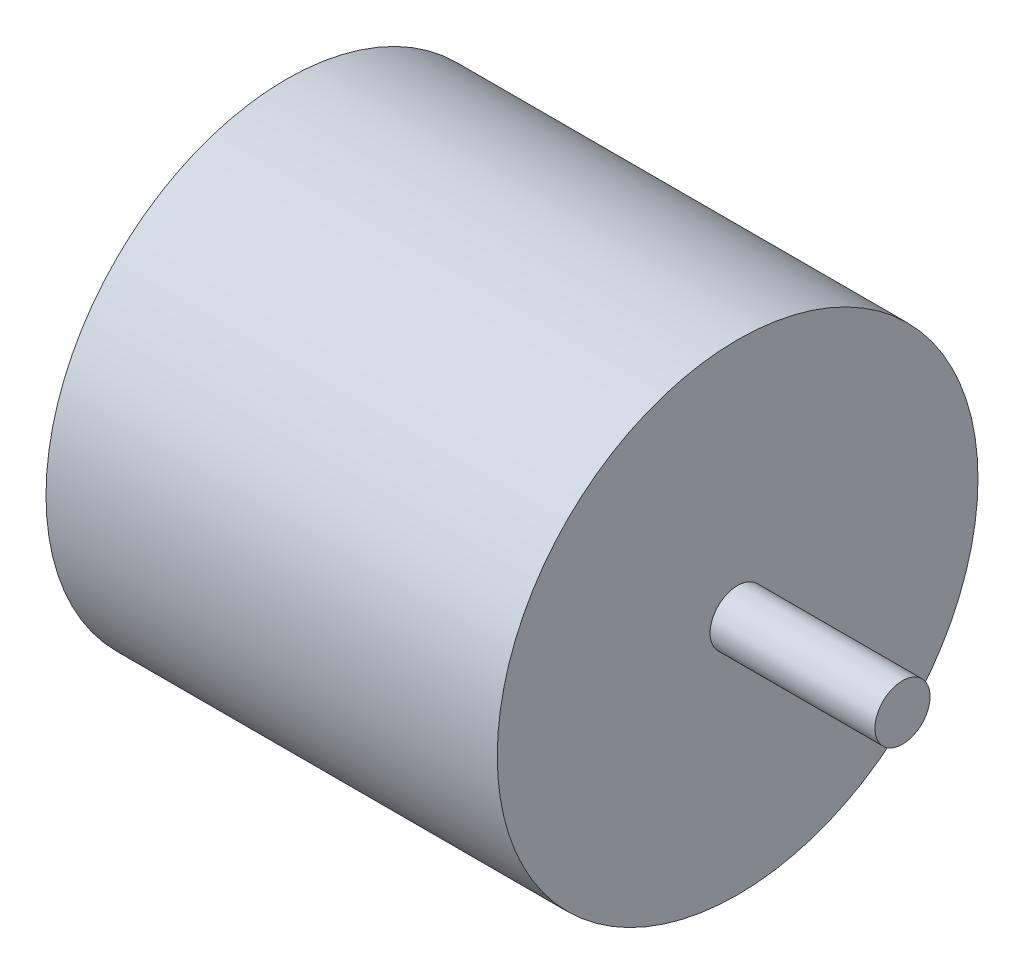
ISO-10303-21;
HEADER;
FILE_DESCRIPTION(('STEP AP214'),'2;1');
FILE_NAME('part.step','',(''),(''),'','','');
FILE_SCHEMA(('AUTOMOTIVE_DESIGN { 1 0 10303 214 1 1 1 1 }'));
ENDSEC;
DATA;
#1=APPLICATION_CONTEXT('core data for automotive mechanical design processes');
#2=APPLICATION_PROTOCOL_DEFINITION('international standard','automotive_design',2000,#1);
#3=PRODUCT_CONTEXT('',#1,'mechanical');
#4=PRODUCT('Part','Part','',(#3));
#5=PRODUCT_RELATED_PRODUCT_CATEGORY('part','',(#4));
#6=PRODUCT_DEFINITION_FORMATION('','',#4);
#7=PRODUCT_DEFINITION_CONTEXT('part definition',#1,'design');
#8=PRODUCT_DEFINITION('design','',#6,#7);
#9=PRODUCT_DEFINITION_SHAPE('','',#8);
#10=(LENGTH_UNIT() NAMED_UNIT(*) SI_UNIT(.MILLI.,.METRE.));
#11=(NAMED_UNIT(*) PLANE_ANGLE_UNIT() SI_UNIT($,.RADIAN.));
#12=(NAMED_UNIT(*) SI_UNIT($,.STERADIAN.) SOLID_ANGLE_UNIT());
#13=UNCERTAINTY_MEASURE_WITH_UNIT(LENGTH_MEASURE(1.E-05),#10,'distance_accuracy_value','');
#14=(GEOMETRIC_REPRESENTATION_CONTEXT(3) GLOBAL_UNCERTAINTY_ASSIGNED_CONTEXT((#13)) GLOBAL_UNIT_ASSIGNED_CONTEXT((#10,
#11,#12)) REPRESENTATION_CONTEXT('',''));
#15=CARTESIAN_POINT('',(0.,0.,0.));
#16=DIRECTION('',(0.,0.,1.));
#17=DIRECTION('',(1.,0.,0.));
#18=AXIS2_PLACEMENT_3D('',#15,#16,#17);
#19=CARTESIAN_POINT('',(-14.5,0.,0.));
#20=DIRECTION('',(1.,0.,0.));
#21=DIRECTION('',(0.,0.,-1.));
#22=AXIS2_PLACEMENT_3D('',#19,#20,#21);
#23=PLANE('',#22);
#24=CARTESIAN_POINT('',(-14.5,0.,0.));
#25=DIRECTION('',(-1.,0.,0.));
#26=DIRECTION('',(0.,0.,1.));
#27=AXIS2_PLACEMENT_3D('',#24,#25,#26);
#28=CIRCLE('',#27,1.5875);
#29=CARTESIAN_POINT('',(-14.5,0.,1.5875));
#30=VERTEX_POINT('',#29);
#31=EDGE_CURVE('E10',#30,#30,#28,.T.);
#32=ORIENTED_EDGE('',*,*,#31,.T.);
#33=EDGE_LOOP('',(#32));
#34=FACE_BOUND('',#33,.T.);
#35=ADVANCED_FACE('F35',(#34),#23,.F.);
#36=CARTESIAN_POINT('',(-313.759242265904,0.,0.));
#37=DIRECTION('',(-1.,0.,0.));
#38=DIRECTION('',(0.,0.,1.));
#39=AXIS2_PLACEMENT_3D('',#36,#37,#38);
#40=CYLINDRICAL_SURFACE('',#39,1.5875);
#41=ORIENTED_EDGE('',*,*,#31,.F.);
#42=EDGE_LOOP('',(#41));
#43=FACE_BOUND('',#42,.T.);
#44=CARTESIAN_POINT('',(-13.,0.,0.));
#45=DIRECTION('',(-1.,0.,0.));
#46=DIRECTION('',(0.,0.,1.));
#47=AXIS2_PLACEMENT_3D('',#44,#45,#46);
#48=CIRCLE('',#47,1.5875);
#49=CARTESIAN_POINT('',(-13.,0.,1.5875));
#50=VERTEX_POINT('',#49);
#51=EDGE_CURVE('E41',#50,#50,#48,.T.);
#52=ORIENTED_EDGE('',*,*,#51,.T.);
#53=EDGE_LOOP('',(#52));
#54=FACE_BOUND('',#53,.T.);
#55=ADVANCED_FACE('F73',(#43,#54),#40,.T.);
#56=CARTESIAN_POINT('',(-13.,1.5875,0.));
#57=DIRECTION('',(1.,0.,0.));
#58=DIRECTION('',(0.,0.,-1.));
#59=AXIS2_PLACEMENT_3D('',#56,#57,#58);
#60=PLANE('',#59);
#61=ORIENTED_EDGE('',*,*,#51,.F.);
#62=EDGE_LOOP('',(#61));
#63=FACE_BOUND('',#62,.T.);
#64=CARTESIAN_POINT('',(-13.,0.,0.));
#65=DIRECTION('',(-1.,0.,0.));
#66=DIRECTION('',(0.,0.,1.));
#67=AXIS2_PLACEMENT_3D('',#64,#65,#66);
#68=CIRCLE('',#67,13.85);
#69=CARTESIAN_POINT('',(-13.,0.,13.85));
#70=VERTEX_POINT('',#69);
#71=EDGE_CURVE('E45',#70,#70,#68,.T.);
#72=ORIENTED_EDGE('',*,*,#71,.T.);
#73=EDGE_LOOP('',(#72));
#74=FACE_BOUND('',#73,.T.);
#75=ADVANCED_FACE('F77',(#63,#74),#60,.F.);
#76=CARTESIAN_POINT('',(-313.759242265904,0.,0.));
#77=DIRECTION('',(-1.,0.,0.));
#78=DIRECTION('',(0.,0.,1.));
#79=AXIS2_PLACEMENT_3D('',#76,#77,#78);
#80=CYLINDRICAL_SURFACE('',#79,13.85);
#81=ORIENTED_EDGE('',*,*,#71,.F.);
#82=EDGE_LOOP('',(#81));
#83=FACE_BOUND('',#82,.T.);
#84=CARTESIAN_POINT('',(13.,0.,0.));
#85=DIRECTION('',(-1.,0.,0.));
#86=DIRECTION('',(0.,0.,1.));
#87=AXIS2_PLACEMENT_3D('',#84,#85,#86);
#88=CIRCLE('',#87,13.85);
#89=CARTESIAN_POINT('',(13.,0.,13.85));
#90=VERTEX_POINT('',#89);
#91=EDGE_CURVE('E49',#90,#90,#88,.T.);
#92=ORIENTED_EDGE('',*,*,#91,.T.);
#93=EDGE_LOOP('',(#92));
#94=FACE_BOUND('',#93,.T.);
#95=ADVANCED_FACE('F82',(#83,#94),#80,.T.);
#96=CARTESIAN_POINT('',(13.,13.85,0.));
#97=DIRECTION('',(-1.,0.,0.));
#98=DIRECTION('',(0.,0.,1.));
#99=AXIS2_PLACEMENT_3D('',#96,#97,#98);
#100=PLANE('',#99);
#101=ORIENTED_EDGE('',*,*,#91,.F.);
#102=EDGE_LOOP('',(#101));
#103=FACE_BOUND('',#102,.T.);
#104=CARTESIAN_POINT('',(13.,0.,0.));
#105=DIRECTION('',(-1.,0.,0.));
#106=DIRECTION('',(0.,0.,1.));
#107=AXIS2_PLACEMENT_3D('',#104,#105,#106);
#108=CIRCLE('',#107,1.5875);
#109=CARTESIAN_POINT('',(13.,0.,1.5875));
#110=VERTEX_POINT('',#109);
#111=EDGE_CURVE('E54',#110,#110,#108,.T.);
#112=ORIENTED_EDGE('',*,*,#111,.T.);
#113=EDGE_LOOP('',(#112));
#114=FACE_BOUND('',#113,.T.);
#115=ADVANCED_FACE('F69',(#103,#114),#100,.F.);
#116=CARTESIAN_POINT('',(-313.759242265904,0.,0.));
#117=DIRECTION('',(-1.,0.,0.));
#118=DIRECTION('',(0.,0.,1.));
#119=AXIS2_PLACEMENT_3D('',#116,#117,#118);
#120=CYLINDRICAL_SURFACE('',#119,1.5875);
#121=ORIENTED_EDGE('',*,*,#111,.F.);
#122=EDGE_LOOP('',(#121));
#123=FACE_BOUND('',#122,.T.);
#124=CARTESIAN_POINT('',(22.5,0.,0.));
#125=DIRECTION('',(-1.,0.,0.));
#126=DIRECTION('',(0.,0.,1.));
#127=AXIS2_PLACEMENT_3D('',#124,#125,#126);
#128=CIRCLE('',#127,1.5875);
#129=CARTESIAN_POINT('',(22.5,0.,1.5875));
#130=VERTEX_POINT('',#129);
#131=EDGE_CURVE('E57',#130,#130,#128,.T.);
#132=ORIENTED_EDGE('',*,*,#131,.T.);
#133=EDGE_LOOP('',(#132));
#134=FACE_BOUND('',#133,.T.);
#135=ADVANCED_FACE('F61',(#123,#134),#120,.T.);
#136=CARTESIAN_POINT('',(22.5,1.5875,0.));
#137=DIRECTION('',(-1.,0.,0.));
#138=DIRECTION('',(0.,0.,1.));
#139=AXIS2_PLACEMENT_3D('',#136,#137,#138);
#140=PLANE('',#139);
#141=ORIENTED_EDGE('',*,*,#131,.F.);
#142=EDGE_LOOP('',(#141));
#143=FACE_BOUND('',#142,.T.);
#144=ADVANCED_FACE('F63',(#143),#140,.F.);
#145=CLOSED_SHELL('',(#35,#55,#75,#95,#115,#135,#144));
#146=MANIFOLD_SOLID_BREP('B2',#145);
#147=ADVANCED_BREP_SHAPE_REPRESENTATION('',(#18,#146),#14);
#148=SHAPE_DEFINITION_REPRESENTATION(#9,#147);
ENDSEC;
END-ISO-10303-21;
